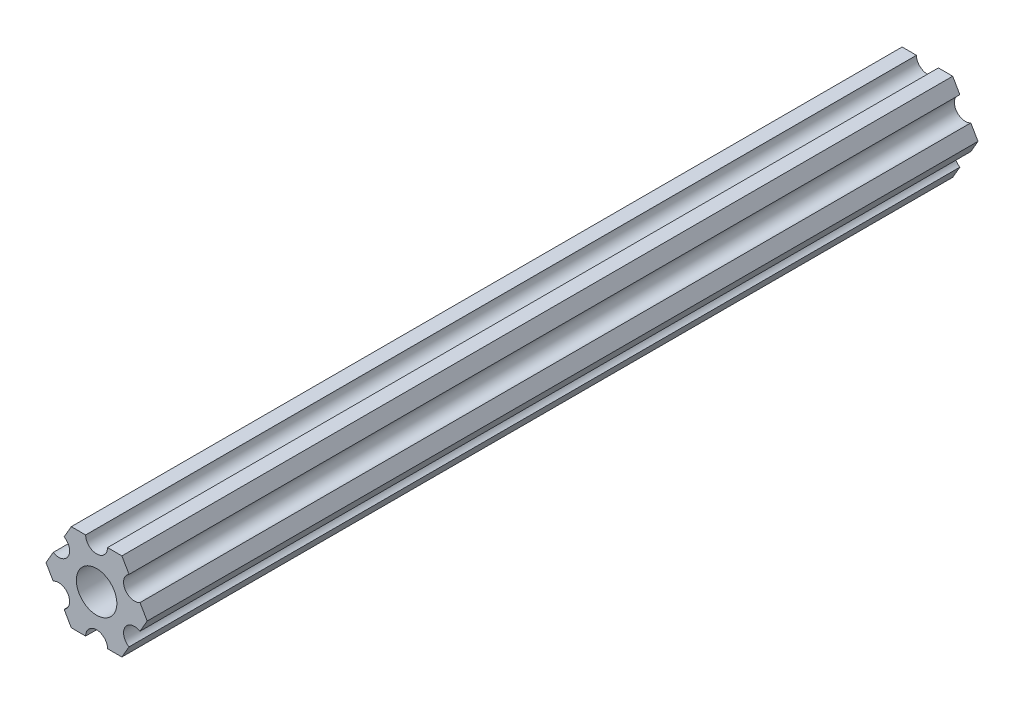
ISO-10303-21;
HEADER;
FILE_DESCRIPTION(('STEP AP214'),'2;1');
FILE_NAME('part.step','',(''),(''),'','','');
FILE_SCHEMA(('AUTOMOTIVE_DESIGN { 1 0 10303 214 1 1 1 1 }'));
ENDSEC;
DATA;
#1=APPLICATION_CONTEXT('core data for automotive mechanical design processes');
#2=APPLICATION_PROTOCOL_DEFINITION('international standard','automotive_design',2000,#1);
#3=PRODUCT_CONTEXT('',#1,'mechanical');
#4=PRODUCT('Part','Part','',(#3));
#5=PRODUCT_RELATED_PRODUCT_CATEGORY('part','',(#4));
#6=PRODUCT_DEFINITION_FORMATION('','',#4);
#7=PRODUCT_DEFINITION_CONTEXT('part definition',#1,'design');
#8=PRODUCT_DEFINITION('design','',#6,#7);
#9=PRODUCT_DEFINITION_SHAPE('','',#8);
#10=(LENGTH_UNIT() NAMED_UNIT(*) SI_UNIT(.MILLI.,.METRE.));
#11=(NAMED_UNIT(*) PLANE_ANGLE_UNIT() SI_UNIT($,.RADIAN.));
#12=(NAMED_UNIT(*) SI_UNIT($,.STERADIAN.) SOLID_ANGLE_UNIT());
#13=UNCERTAINTY_MEASURE_WITH_UNIT(LENGTH_MEASURE(1.E-05),#10,'distance_accuracy_value','');
#14=(GEOMETRIC_REPRESENTATION_CONTEXT(3) GLOBAL_UNCERTAINTY_ASSIGNED_CONTEXT((#13)) GLOBAL_UNIT_ASSIGNED_CONTEXT((#10,
#11,#12)) REPRESENTATION_CONTEXT('',''));
#15=CARTESIAN_POINT('',(0.,0.,0.));
#16=DIRECTION('',(0.,0.,1.));
#17=DIRECTION('',(1.,0.,0.));
#18=AXIS2_PLACEMENT_3D('',#15,#16,#17);
#19=CARTESIAN_POINT('',(6.29301142309098,-1.80018429024546,304.8));
#20=DIRECTION('',(-0.866025434075723,0.499999947533953,0.));
#21=DIRECTION('',(-0.499999947533953,-0.866025434075723,0.));
#22=AXIS2_PLACEMENT_3D('',#19,#20,#21);
#23=PLANE('',#22);
#24=DIRECTION('',(0.499999947533953,0.866025434075723,0.));
#25=VECTOR('',#24,1.);
#26=CARTESIAN_POINT('',(6.29301142309098,-1.80018429024546,-52.7));
#27=LINE('',#26,#25);
#28=CARTESIAN_POINT('',(6.29301142309098,-1.80018429024546,-52.7));
#29=VERTEX_POINT('',#28);
#30=CARTESIAN_POINT('',(7.33234841870826,4.44212518896171E-07,-52.7));
#31=VERTEX_POINT('',#30);
#32=EDGE_CURVE('E140',#29,#31,#27,.T.);
#33=ORIENTED_EDGE('',*,*,#32,.T.);
#34=DIRECTION('',(0.,0.,1.));
#35=VECTOR('',#34,1.);
#36=CARTESIAN_POINT('',(7.33234841870826,4.44212519225153E-07,304.8));
#37=LINE('',#36,#35);
#38=CARTESIAN_POINT('',(7.33234841870826,4.44212519207655E-07,67.726));
#39=VERTEX_POINT('',#38);
#40=EDGE_CURVE('E127',#31,#39,#37,.T.);
#41=ORIENTED_EDGE('',*,*,#40,.T.);
#42=DIRECTION('',(0.499999947533953,0.866025434075723,0.));
#43=VECTOR('',#42,1.);
#44=CARTESIAN_POINT('',(6.29301142309098,-1.80018429024546,67.726));
#45=LINE('',#44,#43);
#46=CARTESIAN_POINT('',(6.29301142309098,-1.80018429024546,67.726));
#47=VERTEX_POINT('',#46);
#48=EDGE_CURVE('E146',#47,#39,#45,.T.);
#49=ORIENTED_EDGE('',*,*,#48,.F.);
#50=DIRECTION('',(0.,0.,-1.));
#51=VECTOR('',#50,1.);
#52=CARTESIAN_POINT('',(6.29301142309098,-1.80018429024546,304.8));
#53=LINE('',#52,#51);
#54=EDGE_CURVE('E145',#47,#29,#53,.T.);
#55=ORIENTED_EDGE('',*,*,#54,.T.);
#56=EDGE_LOOP('',(#33,#41,#49,#55));
#57=FACE_BOUND('',#56,.T.);
#58=ADVANCED_FACE('F16',(#57),#23,.F.);
#59=CARTESIAN_POINT('',(7.33234841870826,4.44212519169686E-07,304.8));
#60=DIRECTION('',(-0.866025373493145,-0.500000052466056,0.));
#61=DIRECTION('',(0.500000052466056,-0.866025373493145,0.));
#62=AXIS2_PLACEMENT_3D('',#59,#60,#61);
#63=PLANE('',#62);
#64=DIRECTION('',(-0.500000052466056,0.866025373493145,0.));
#65=VECTOR('',#64,1.);
#66=CARTESIAN_POINT('',(7.33234841870826,4.44212519198905E-07,-52.7));
#67=LINE('',#66,#65);
#68=CARTESIAN_POINT('',(6.29301120497139,1.80018505273894,-52.7));
#69=VERTEX_POINT('',#68);
#70=EDGE_CURVE('E130',#31,#69,#67,.T.);
#71=ORIENTED_EDGE('',*,*,#70,.T.);
#72=DIRECTION('',(0.,0.,-1.));
#73=VECTOR('',#72,1.);
#74=CARTESIAN_POINT('',(6.29301120497139,1.80018505273894,304.8));
#75=LINE('',#74,#73);
#76=CARTESIAN_POINT('',(6.29301120497139,1.80018505273894,67.726));
#77=VERTEX_POINT('',#76);
#78=EDGE_CURVE('E119',#69,#77,#75,.F.);
#79=ORIENTED_EDGE('',*,*,#78,.T.);
#80=DIRECTION('',(-0.500000052466056,0.866025373493145,0.));
#81=VECTOR('',#80,1.);
#82=CARTESIAN_POINT('',(7.33234841870826,4.44212519198905E-07,67.726));
#83=LINE('',#82,#81);
#84=EDGE_CURVE('E131',#39,#77,#83,.T.);
#85=ORIENTED_EDGE('',*,*,#84,.F.);
#86=ORIENTED_EDGE('',*,*,#40,.F.);
#87=EDGE_LOOP('',(#71,#79,#85,#86));
#88=FACE_BOUND('',#87,.T.);
#89=ADVANCED_FACE('F129',(#88),#63,.F.);
#90=CARTESIAN_POINT('',(5.49926112168156,3.17500033315933,304.8));
#91=DIRECTION('',(0.,0.,-1.));
#92=DIRECTION('',(-1.,0.,0.));
#93=AXIS2_PLACEMENT_3D('',#90,#91,#92);
#94=CYLINDRICAL_SURFACE('',#93,1.5875);
#95=CARTESIAN_POINT('',(5.49926112168156,3.17500033315933,-52.7));
#96=DIRECTION('',(0.,0.,-1.));
#97=DIRECTION('',(-1.,0.,0.));
#98=AXIS2_PLACEMENT_3D('',#95,#96,#97);
#99=CIRCLE('',#98,1.5875);
#100=CARTESIAN_POINT('',(4.70551103839172,4.54981561357972,-52.7));
#101=VERTEX_POINT('',#100);
#102=EDGE_CURVE('E19',#69,#101,#99,.T.);
#103=ORIENTED_EDGE('',*,*,#102,.T.);
#104=DIRECTION('',(0.,0.,1.));
#105=VECTOR('',#104,1.);
#106=CARTESIAN_POINT('',(4.70551103839172,4.54981561357972,304.8));
#107=LINE('',#106,#105);
#108=CARTESIAN_POINT('',(4.70551103839172,4.54981561357972,67.726));
#109=VERTEX_POINT('',#108);
#110=EDGE_CURVE('E262',#101,#109,#107,.T.);
#111=ORIENTED_EDGE('',*,*,#110,.T.);
#112=CARTESIAN_POINT('',(5.49926112168156,3.17500033315933,67.726));
#113=DIRECTION('',(0.,0.,-1.));
#114=DIRECTION('',(-1.,0.,0.));
#115=AXIS2_PLACEMENT_3D('',#112,#113,#114);
#116=CIRCLE('',#115,1.5875);
#117=EDGE_CURVE('E290',#77,#109,#116,.T.);
#118=ORIENTED_EDGE('',*,*,#117,.F.);
#119=ORIENTED_EDGE('',*,*,#78,.F.);
#120=EDGE_LOOP('',(#103,#111,#118,#119));
#121=FACE_BOUND('',#120,.T.);
#122=ADVANCED_FACE('F560',(#121),#94,.F.);
#123=CARTESIAN_POINT('',(4.70551103839172,4.54981561357972,304.8));
#124=DIRECTION('',(-0.866025373493151,-0.500000052466046,0.));
#125=DIRECTION('',(0.500000052466046,-0.866025373493151,0.));
#126=AXIS2_PLACEMENT_3D('',#123,#124,#125);
#127=PLANE('',#126);
#128=DIRECTION('',(-0.500000052466044,0.866025373493152,0.));
#129=VECTOR('',#128,1.);
#130=CARTESIAN_POINT('',(4.70551103839172,4.54981561357972,-52.7));
#131=LINE('',#130,#129);
#132=CARTESIAN_POINT('',(3.66617382465481,6.35000022210627,-52.7000000000001));
#133=VERTEX_POINT('',#132);
#134=EDGE_CURVE('E204',#101,#133,#131,.T.);
#135=ORIENTED_EDGE('',*,*,#134,.T.);
#136=DIRECTION('',(0.,0.,1.));
#137=VECTOR('',#136,1.);
#138=CARTESIAN_POINT('',(3.66617382465481,6.35000022210627,304.8));
#139=LINE('',#138,#137);
#140=CARTESIAN_POINT('',(3.66617382465481,6.35000022210627,67.726));
#141=VERTEX_POINT('',#140);
#142=EDGE_CURVE('E259',#133,#141,#139,.T.);
#143=ORIENTED_EDGE('',*,*,#142,.T.);
#144=DIRECTION('',(-0.500000052466044,0.866025373493152,0.));
#145=VECTOR('',#144,1.);
#146=CARTESIAN_POINT('',(4.70551103839172,4.54981561357972,67.726));
#147=LINE('',#146,#145);
#148=EDGE_CURVE('E291',#109,#141,#147,.T.);
#149=ORIENTED_EDGE('',*,*,#148,.F.);
#150=ORIENTED_EDGE('',*,*,#110,.F.);
#151=EDGE_LOOP('',(#135,#143,#149,#150));
#152=FACE_BOUND('',#151,.T.);
#153=ADVANCED_FACE('F314',(#152),#127,.F.);
#154=CARTESIAN_POINT('',(3.66617382465481,6.35000022210627,304.8));
#155=DIRECTION('',(6.05825850611185E-08,-0.999999999999998,0.));
#156=DIRECTION('',(0.999999999999998,6.05825850611185E-08,0.));
#157=AXIS2_PLACEMENT_3D('',#154,#155,#156);
#158=PLANE('',#157);
#159=DIRECTION('',(1.,0.,0.));
#160=VECTOR('',#159,1.);
#161=CARTESIAN_POINT('',(5.49926112168156,6.35000022210627,-52.7));
#162=LINE('',#161,#160);
#163=CARTESIAN_POINT('',(1.58749961530073,6.35000015914054,-52.7));
#164=VERTEX_POINT('',#163);
#165=EDGE_CURVE('E201',#133,#164,#162,.F.);
#166=ORIENTED_EDGE('',*,*,#165,.T.);
#167=DIRECTION('',(0.,0.,-1.));
#168=VECTOR('',#167,1.);
#169=CARTESIAN_POINT('',(1.58749961530074,6.35000009617482,304.8));
#170=LINE('',#169,#168);
#171=CARTESIAN_POINT('',(1.58749961530073,6.35000015914054,67.726));
#172=VERTEX_POINT('',#171);
#173=EDGE_CURVE('E256',#164,#172,#170,.F.);
#174=ORIENTED_EDGE('',*,*,#173,.T.);
#175=DIRECTION('',(1.,0.,0.));
#176=VECTOR('',#175,1.);
#177=CARTESIAN_POINT('',(5.49926112168156,6.35000022210627,67.726));
#178=LINE('',#177,#176);
#179=EDGE_CURVE('E289',#141,#172,#178,.F.);
#180=ORIENTED_EDGE('',*,*,#179,.F.);
#181=ORIENTED_EDGE('',*,*,#142,.F.);
#182=EDGE_LOOP('',(#166,#174,#180,#181));
#183=FACE_BOUND('',#182,.T.);
#184=ADVANCED_FACE('F309',(#183),#158,.F.);
#185=CARTESIAN_POINT('',(-3.84699260060323E-07,6.35,304.8));
#186=DIRECTION('',(0.,0.,-1.));
#187=DIRECTION('',(-1.,0.,0.));
#188=AXIS2_PLACEMENT_3D('',#185,#186,#187);
#189=CYLINDRICAL_SURFACE('',#188,1.5875);
#190=CARTESIAN_POINT('',(-3.84699260060323E-07,6.35,-52.7));
#191=DIRECTION('',(0.,0.,-1.));
#192=DIRECTION('',(-1.,0.,0.));
#193=AXIS2_PLACEMENT_3D('',#190,#191,#192);
#194=CIRCLE('',#193,1.5875);
#195=CARTESIAN_POINT('',(-1.58750038469926,6.34999990382518,-52.7));
#196=VERTEX_POINT('',#195);
#197=EDGE_CURVE('E198',#164,#196,#194,.T.);
#198=ORIENTED_EDGE('',*,*,#197,.T.);
#199=DIRECTION('',(0.,0.,1.));
#200=VECTOR('',#199,1.);
#201=CARTESIAN_POINT('',(-1.58750038469926,6.34999990382518,304.8));
#202=LINE('',#201,#200);
#203=CARTESIAN_POINT('',(-1.58750038469926,6.34999990382518,67.726));
#204=VERTEX_POINT('',#203);
#205=EDGE_CURVE('E251',#196,#204,#202,.T.);
#206=ORIENTED_EDGE('',*,*,#205,.T.);
#207=CARTESIAN_POINT('',(-3.84699260060323E-07,6.35,67.726));
#208=DIRECTION('',(0.,0.,-1.));
#209=DIRECTION('',(-1.,0.,0.));
#210=AXIS2_PLACEMENT_3D('',#207,#208,#209);
#211=CIRCLE('',#210,1.5875);
#212=EDGE_CURVE('E286',#172,#204,#211,.T.);
#213=ORIENTED_EDGE('',*,*,#212,.F.);
#214=ORIENTED_EDGE('',*,*,#173,.F.);
#215=EDGE_LOOP('',(#198,#206,#213,#214));
#216=FACE_BOUND('',#215,.T.);
#217=ADVANCED_FACE('F301',(#216),#189,.F.);
#218=CARTESIAN_POINT('',(-1.58750038469926,6.34999990382518,304.8));
#219=DIRECTION('',(6.05825963273174E-08,-0.999999999999998,0.));
#220=DIRECTION('',(0.999999999999998,6.05825963273174E-08,0.));
#221=AXIS2_PLACEMENT_3D('',#218,#219,#220);
#222=PLANE('',#221);
#223=DIRECTION('',(1.,0.,0.));
#224=VECTOR('',#223,1.);
#225=CARTESIAN_POINT('',(5.49926112168156,6.34999990382519,-52.7));
#226=LINE('',#225,#224);
#227=CARTESIAN_POINT('',(-3.66617454558244,6.34999986184803,-52.7000000000001));
#228=VERTEX_POINT('',#227);
#229=EDGE_CURVE('E193',#196,#228,#226,.F.);
#230=ORIENTED_EDGE('',*,*,#229,.T.);
#231=DIRECTION('',(0.,0.,1.));
#232=VECTOR('',#231,1.);
#233=CARTESIAN_POINT('',(-3.66617459405349,6.3499997778937,304.8));
#234=LINE('',#233,#232);
#235=CARTESIAN_POINT('',(-3.66617454558244,6.34999986184803,67.726));
#236=VERTEX_POINT('',#235);
#237=EDGE_CURVE('E248',#228,#236,#234,.T.);
#238=ORIENTED_EDGE('',*,*,#237,.T.);
#239=DIRECTION('',(1.,0.,0.));
#240=VECTOR('',#239,1.);
#241=CARTESIAN_POINT('',(5.49926112168156,6.34999990382519,67.726));
#242=LINE('',#241,#240);
#243=EDGE_CURVE('E288',#204,#236,#242,.F.);
#244=ORIENTED_EDGE('',*,*,#243,.F.);
#245=ORIENTED_EDGE('',*,*,#205,.F.);
#246=EDGE_LOOP('',(#230,#238,#244,#245));
#247=FACE_BOUND('',#246,.T.);
#248=ADVANCED_FACE('F369',(#247),#222,.F.);
#249=CARTESIAN_POINT('',(-3.66617459405349,6.3499997778937,304.8));
#250=DIRECTION('',(0.866025434075729,-0.499999947533943,0.));
#251=DIRECTION('',(0.499999947533943,0.866025434075729,0.));
#252=AXIS2_PLACEMENT_3D('',#249,#250,#251);
#253=PLANE('',#252);
#254=DIRECTION('',(-0.499999947533941,-0.86602543407573,0.));
#255=VECTOR('',#254,1.);
#256=CARTESIAN_POINT('',(-3.66617459405349,6.3499997778937,-52.7));
#257=LINE('',#256,#255);
#258=CARTESIAN_POINT('',(-4.70551158967065,4.54981504343587,-52.7));
#259=VERTEX_POINT('',#258);
#260=EDGE_CURVE('E190',#228,#259,#257,.T.);
#261=ORIENTED_EDGE('',*,*,#260,.T.);
#262=DIRECTION('',(0.,0.,-1.));
#263=VECTOR('',#262,1.);
#264=CARTESIAN_POINT('',(-4.70551158967065,4.54981504343587,304.8));
#265=LINE('',#264,#263);
#266=CARTESIAN_POINT('',(-4.70551158967065,4.54981504343587,67.726));
#267=VERTEX_POINT('',#266);
#268=EDGE_CURVE('E245',#259,#267,#265,.F.);
#269=ORIENTED_EDGE('',*,*,#268,.T.);
#270=DIRECTION('',(-0.499999947533941,-0.86602543407573,0.));
#271=VECTOR('',#270,1.);
#272=CARTESIAN_POINT('',(-3.66617459405349,6.3499997778937,67.726));
#273=LINE('',#272,#271);
#274=EDGE_CURVE('E285',#236,#267,#273,.T.);
#275=ORIENTED_EDGE('',*,*,#274,.F.);
#276=ORIENTED_EDGE('',*,*,#237,.F.);
#277=EDGE_LOOP('',(#261,#269,#275,#276));
#278=FACE_BOUND('',#277,.T.);
#279=ADVANCED_FACE('F371',(#278),#253,.F.);
#280=CARTESIAN_POINT('',(-5.49926150638082,3.17499966684067,304.8));
#281=DIRECTION('',(0.,0.,-1.));
#282=DIRECTION('',(-1.,0.,0.));
#283=AXIS2_PLACEMENT_3D('',#280,#281,#282);
#284=CYLINDRICAL_SURFACE('',#283,1.5875);
#285=CARTESIAN_POINT('',(-5.49926150638082,3.17499966684067,-52.7));
#286=DIRECTION('',(0.,0.,-1.));
#287=DIRECTION('',(-1.,0.,0.));
#288=AXIS2_PLACEMENT_3D('',#285,#286,#287);
#289=CIRCLE('',#288,1.5875);
#290=CARTESIAN_POINT('',(-6.29301142309098,1.80018429024547,-52.7));
#291=VERTEX_POINT('',#290);
#292=EDGE_CURVE('E187',#259,#291,#289,.T.);
#293=ORIENTED_EDGE('',*,*,#292,.T.);
#294=DIRECTION('',(0.,0.,1.));
#295=VECTOR('',#294,1.);
#296=CARTESIAN_POINT('',(-6.29301142309098,1.80018429024547,304.8));
#297=LINE('',#296,#295);
#298=CARTESIAN_POINT('',(-6.29301142309098,1.80018429024547,67.726));
#299=VERTEX_POINT('',#298);
#300=EDGE_CURVE('E240',#291,#299,#297,.T.);
#301=ORIENTED_EDGE('',*,*,#300,.T.);
#302=CARTESIAN_POINT('',(-5.49926150638082,3.17499966684067,67.726));
#303=DIRECTION('',(0.,0.,-1.));
#304=DIRECTION('',(-1.,0.,0.));
#305=AXIS2_PLACEMENT_3D('',#302,#303,#304);
#306=CIRCLE('',#305,1.5875);
#307=EDGE_CURVE('E282',#267,#299,#306,.T.);
#308=ORIENTED_EDGE('',*,*,#307,.F.);
#309=ORIENTED_EDGE('',*,*,#268,.F.);
#310=EDGE_LOOP('',(#293,#301,#308,#309));
#311=FACE_BOUND('',#310,.T.);
#312=ADVANCED_FACE('F407',(#311),#284,.F.);
#313=CARTESIAN_POINT('',(-6.29301142309098,1.80018429024547,304.8));
#314=DIRECTION('',(0.866025434075724,-0.499999947533951,0.));
#315=DIRECTION('',(0.499999947533951,0.866025434075724,0.));
#316=AXIS2_PLACEMENT_3D('',#313,#314,#315);
#317=PLANE('',#316);
#318=DIRECTION('',(-0.49999994753395,-0.866025434075724,0.));
#319=VECTOR('',#318,1.);
#320=CARTESIAN_POINT('',(-6.29301142309098,1.80018429024547,-52.7));
#321=LINE('',#320,#319);
#322=CARTESIAN_POINT('',(-7.33234841870826,-4.44212523605446E-07,-52.7000000000001));
#323=VERTEX_POINT('',#322);
#324=EDGE_CURVE('E182',#291,#323,#321,.T.);
#325=ORIENTED_EDGE('',*,*,#324,.T.);
#326=DIRECTION('',(0.,0.,1.));
#327=VECTOR('',#326,1.);
#328=CARTESIAN_POINT('',(-7.33234841870826,-4.44212523744911E-07,304.8));
#329=LINE('',#328,#327);
#330=CARTESIAN_POINT('',(-7.33234841870826,-4.44212523605446E-07,67.726));
#331=VERTEX_POINT('',#330);
#332=EDGE_CURVE('E237',#323,#331,#329,.T.);
#333=ORIENTED_EDGE('',*,*,#332,.T.);
#334=DIRECTION('',(-0.49999994753395,-0.866025434075724,0.));
#335=VECTOR('',#334,1.);
#336=CARTESIAN_POINT('',(-6.29301142309098,1.80018429024547,67.726));
#337=LINE('',#336,#335);
#338=EDGE_CURVE('E284',#299,#331,#337,.T.);
#339=ORIENTED_EDGE('',*,*,#338,.F.);
#340=ORIENTED_EDGE('',*,*,#300,.F.);
#341=EDGE_LOOP('',(#325,#333,#339,#340));
#342=FACE_BOUND('',#341,.T.);
#343=ADVANCED_FACE('F360',(#342),#317,.F.);
#344=CARTESIAN_POINT('',(-7.33234841870826,-4.44212523790841E-07,304.8));
#345=DIRECTION('',(0.866025373493151,0.500000052466045,0.));
#346=DIRECTION('',(-0.500000052466045,0.866025373493151,0.));
#347=AXIS2_PLACEMENT_3D('',#344,#345,#346);
#348=PLANE('',#347);
#349=DIRECTION('',(0.500000052466043,-0.866025373493152,0.));
#350=VECTOR('',#349,1.);
#351=CARTESIAN_POINT('',(-7.33234841870826,-4.44212523535714E-07,-52.7));
#352=LINE('',#351,#350);
#353=CARTESIAN_POINT('',(-6.29301120497141,-1.80018505273897,-52.7));
#354=VERTEX_POINT('',#353);
#355=EDGE_CURVE('E179',#323,#354,#352,.T.);
#356=ORIENTED_EDGE('',*,*,#355,.T.);
#357=DIRECTION('',(0.,0.,-1.));
#358=VECTOR('',#357,1.);
#359=CARTESIAN_POINT('',(-6.29301120497141,-1.80018505273897,304.8));
#360=LINE('',#359,#358);
#361=CARTESIAN_POINT('',(-6.29301120497141,-1.80018505273897,67.726));
#362=VERTEX_POINT('',#361);
#363=EDGE_CURVE('E234',#354,#362,#360,.F.);
#364=ORIENTED_EDGE('',*,*,#363,.T.);
#365=DIRECTION('',(0.500000052466043,-0.866025373493152,0.));
#366=VECTOR('',#365,1.);
#367=CARTESIAN_POINT('',(-7.33234841870826,-4.44212523535714E-07,67.726));
#368=LINE('',#367,#366);
#369=EDGE_CURVE('E281',#331,#362,#368,.T.);
#370=ORIENTED_EDGE('',*,*,#369,.F.);
#371=ORIENTED_EDGE('',*,*,#332,.F.);
#372=EDGE_LOOP('',(#356,#364,#370,#371));
#373=FACE_BOUND('',#372,.T.);
#374=ADVANCED_FACE('F355',(#373),#348,.F.);
#375=CARTESIAN_POINT('',(-5.49926112168156,-3.17500033315934,304.8));
#376=DIRECTION('',(0.,0.,-1.));
#377=DIRECTION('',(-1.,0.,0.));
#378=AXIS2_PLACEMENT_3D('',#375,#376,#377);
#379=CYLINDRICAL_SURFACE('',#378,1.5875);
#380=CARTESIAN_POINT('',(-5.49926112168156,-3.17500033315934,-52.7));
#381=DIRECTION('',(0.,0.,-1.));
#382=DIRECTION('',(-1.,0.,0.));
#383=AXIS2_PLACEMENT_3D('',#380,#381,#382);
#384=CIRCLE('',#383,1.5875);
#385=CARTESIAN_POINT('',(-4.70551103839172,-4.54981561357972,-52.7));
#386=VERTEX_POINT('',#385);
#387=EDGE_CURVE('E176',#354,#386,#384,.T.);
#388=ORIENTED_EDGE('',*,*,#387,.T.);
#389=DIRECTION('',(0.,0.,1.));
#390=VECTOR('',#389,1.);
#391=CARTESIAN_POINT('',(-4.70551103839172,-4.54981561357972,304.8));
#392=LINE('',#391,#390);
#393=CARTESIAN_POINT('',(-4.70551103839172,-4.54981561357972,67.726));
#394=VERTEX_POINT('',#393);
#395=EDGE_CURVE('E229',#386,#394,#392,.T.);
#396=ORIENTED_EDGE('',*,*,#395,.T.);
#397=CARTESIAN_POINT('',(-5.49926112168156,-3.17500033315934,67.726));
#398=DIRECTION('',(0.,0.,-1.));
#399=DIRECTION('',(-1.,0.,0.));
#400=AXIS2_PLACEMENT_3D('',#397,#398,#399);
#401=CIRCLE('',#400,1.5875);
#402=EDGE_CURVE('E278',#362,#394,#401,.T.);
#403=ORIENTED_EDGE('',*,*,#402,.F.);
#404=ORIENTED_EDGE('',*,*,#363,.F.);
#405=EDGE_LOOP('',(#388,#396,#403,#404));
#406=FACE_BOUND('',#405,.T.);
#407=ADVANCED_FACE('F350',(#406),#379,.F.);
#408=CARTESIAN_POINT('',(-4.70551103839172,-4.54981561357972,304.8));
#409=DIRECTION('',(0.866025373493151,0.500000052466045,0.));
#410=DIRECTION('',(-0.500000052466045,0.866025373493151,0.));
#411=AXIS2_PLACEMENT_3D('',#408,#409,#410);
#412=PLANE('',#411);
#413=DIRECTION('',(0.500000052466043,-0.866025373493152,0.));
#414=VECTOR('',#413,1.);
#415=CARTESIAN_POINT('',(-4.70551103839172,-4.54981561357972,-52.7));
#416=LINE('',#415,#414);
#417=CARTESIAN_POINT('',(-3.66617382465481,-6.35000022210627,-52.7000000000001));
#418=VERTEX_POINT('',#417);
#419=EDGE_CURVE('E171',#386,#418,#416,.T.);
#420=ORIENTED_EDGE('',*,*,#419,.T.);
#421=DIRECTION('',(0.,0.,1.));
#422=VECTOR('',#421,1.);
#423=CARTESIAN_POINT('',(-3.66617382465481,-6.35000022210627,304.8));
#424=LINE('',#423,#422);
#425=CARTESIAN_POINT('',(-3.66617382465481,-6.35000022210627,67.726));
#426=VERTEX_POINT('',#425);
#427=EDGE_CURVE('E226',#418,#426,#424,.T.);
#428=ORIENTED_EDGE('',*,*,#427,.T.);
#429=DIRECTION('',(0.500000052466043,-0.866025373493152,0.));
#430=VECTOR('',#429,1.);
#431=CARTESIAN_POINT('',(-4.70551103839172,-4.54981561357972,67.726));
#432=LINE('',#431,#430);
#433=EDGE_CURVE('E280',#394,#426,#432,.T.);
#434=ORIENTED_EDGE('',*,*,#433,.F.);
#435=ORIENTED_EDGE('',*,*,#395,.F.);
#436=EDGE_LOOP('',(#420,#428,#434,#435));
#437=FACE_BOUND('',#436,.T.);
#438=ADVANCED_FACE('F345',(#437),#412,.F.);
#439=CARTESIAN_POINT('',(-3.66617382465481,-6.35000022210627,304.8));
#440=DIRECTION('',(-6.05825854783851E-08,0.999999999999998,0.));
#441=DIRECTION('',(-0.999999999999998,-6.05825854783851E-08,0.));
#442=AXIS2_PLACEMENT_3D('',#439,#440,#441);
#443=PLANE('',#442);
#444=DIRECTION('',(1.,0.,0.));
#445=VECTOR('',#444,1.);
#446=CARTESIAN_POINT('',(5.49926112168156,-6.35000022210627,-52.7));
#447=LINE('',#446,#445);
#448=CARTESIAN_POINT('',(-1.58749961530073,-6.35000011105313,-52.7));
#449=VERTEX_POINT('',#448);
#450=EDGE_CURVE('E168',#418,#449,#447,.T.);
#451=ORIENTED_EDGE('',*,*,#450,.T.);
#452=DIRECTION('',(0.,0.,-1.));
#453=VECTOR('',#452,1.);
#454=CARTESIAN_POINT('',(-1.58749961530074,-6.35,304.8));
#455=LINE('',#454,#453);
#456=CARTESIAN_POINT('',(-1.58749961530073,-6.35000011105313,67.726));
#457=VERTEX_POINT('',#456);
#458=EDGE_CURVE('E223',#449,#457,#455,.F.);
#459=ORIENTED_EDGE('',*,*,#458,.T.);
#460=DIRECTION('',(1.,0.,0.));
#461=VECTOR('',#460,1.);
#462=CARTESIAN_POINT('',(5.49926112168156,-6.35000022210627,67.726));
#463=LINE('',#462,#461);
#464=EDGE_CURVE('E277',#426,#457,#463,.T.);
#465=ORIENTED_EDGE('',*,*,#464,.F.);
#466=ORIENTED_EDGE('',*,*,#427,.F.);
#467=EDGE_LOOP('',(#451,#459,#465,#466));
#468=FACE_BOUND('',#467,.T.);
#469=ADVANCED_FACE('F339',(#468),#443,.F.);
#470=CARTESIAN_POINT('',(3.8469926204343E-07,-6.35,304.8));
#471=DIRECTION('',(0.,0.,-1.));
#472=DIRECTION('',(-1.,0.,0.));
#473=AXIS2_PLACEMENT_3D('',#470,#471,#472);
#474=CYLINDRICAL_SURFACE('',#473,1.5875);
#475=CARTESIAN_POINT('',(3.8469926204343E-07,-6.35,-52.7));
#476=DIRECTION('',(0.,0.,-1.));
#477=DIRECTION('',(-1.,0.,0.));
#478=AXIS2_PLACEMENT_3D('',#475,#476,#477);
#479=CIRCLE('',#478,1.5875);
#480=CARTESIAN_POINT('',(1.58750038469926,-6.34999990382518,-52.7));
#481=VERTEX_POINT('',#480);
#482=EDGE_CURVE('E165',#449,#481,#479,.T.);
#483=ORIENTED_EDGE('',*,*,#482,.T.);
#484=DIRECTION('',(0.,0.,1.));
#485=VECTOR('',#484,1.);
#486=CARTESIAN_POINT('',(1.58750038469926,-6.34999990382518,304.8));
#487=LINE('',#486,#485);
#488=CARTESIAN_POINT('',(1.58750038469926,-6.34999990382518,67.726));
#489=VERTEX_POINT('',#488);
#490=EDGE_CURVE('E218',#481,#489,#487,.T.);
#491=ORIENTED_EDGE('',*,*,#490,.T.);
#492=CARTESIAN_POINT('',(3.8469926204343E-07,-6.35,67.726));
#493=DIRECTION('',(0.,0.,-1.));
#494=DIRECTION('',(-1.,0.,0.));
#495=AXIS2_PLACEMENT_3D('',#492,#493,#494);
#496=CIRCLE('',#495,1.5875);
#497=EDGE_CURVE('E274',#457,#489,#496,.T.);
#498=ORIENTED_EDGE('',*,*,#497,.F.);
#499=ORIENTED_EDGE('',*,*,#458,.F.);
#500=EDGE_LOOP('',(#483,#491,#498,#499));
#501=FACE_BOUND('',#500,.T.);
#502=ADVANCED_FACE('F335',(#501),#474,.F.);
#503=CARTESIAN_POINT('',(1.58750038469926,-6.34999990382518,304.8));
#504=DIRECTION('',(-6.05825721258438E-08,0.999999999999998,0.));
#505=DIRECTION('',(-0.999999999999998,-6.05825721258438E-08,0.));
#506=AXIS2_PLACEMENT_3D('',#503,#504,#505);
#507=PLANE('',#506);
#508=DIRECTION('',(1.,0.,0.));
#509=VECTOR('',#508,1.);
#510=CARTESIAN_POINT('',(5.49926112168156,-6.34999990382518,-52.7));
#511=LINE('',#510,#509);
#512=CARTESIAN_POINT('',(3.66617454558244,-6.34999986184804,-52.7));
#513=VERTEX_POINT('',#512);
#514=EDGE_CURVE('E160',#481,#513,#511,.T.);
#515=ORIENTED_EDGE('',*,*,#514,.T.);
#516=DIRECTION('',(0.,0.,1.));
#517=VECTOR('',#516,1.);
#518=CARTESIAN_POINT('',(3.66617459405346,-6.34999977789375,304.8));
#519=LINE('',#518,#517);
#520=CARTESIAN_POINT('',(3.66617454558244,-6.34999986184804,67.726));
#521=VERTEX_POINT('',#520);
#522=EDGE_CURVE('E215',#513,#521,#519,.T.);
#523=ORIENTED_EDGE('',*,*,#522,.T.);
#524=DIRECTION('',(1.,0.,0.));
#525=VECTOR('',#524,1.);
#526=CARTESIAN_POINT('',(5.49926112168156,-6.34999990382518,67.726));
#527=LINE('',#526,#525);
#528=EDGE_CURVE('E276',#489,#521,#527,.T.);
#529=ORIENTED_EDGE('',*,*,#528,.F.);
#530=ORIENTED_EDGE('',*,*,#490,.F.);
#531=EDGE_LOOP('',(#515,#523,#529,#530));
#532=FACE_BOUND('',#531,.T.);
#533=ADVANCED_FACE('F331',(#532),#507,.F.);
#534=CARTESIAN_POINT('',(3.66617459405346,-6.34999977789375,304.8));
#535=DIRECTION('',(-0.86602543407573,0.499999947533941,0.));
#536=DIRECTION('',(-0.499999947533941,-0.86602543407573,0.));
#537=AXIS2_PLACEMENT_3D('',#534,#535,#536);
#538=PLANE('',#537);
#539=DIRECTION('',(0.499999947533941,0.86602543407573,0.));
#540=VECTOR('',#539,1.);
#541=CARTESIAN_POINT('',(3.66617459405346,-6.34999977789375,-52.7));
#542=LINE('',#541,#540);
#543=CARTESIAN_POINT('',(4.70551158967065,-4.54981504343588,-52.7));
#544=VERTEX_POINT('',#543);
#545=EDGE_CURVE('E151',#513,#544,#542,.T.);
#546=ORIENTED_EDGE('',*,*,#545,.T.);
#547=DIRECTION('',(0.,0.,-1.));
#548=VECTOR('',#547,1.);
#549=CARTESIAN_POINT('',(4.70551158967065,-4.54981504343588,304.8));
#550=LINE('',#549,#548);
#551=CARTESIAN_POINT('',(4.70551158967065,-4.54981504343588,67.726));
#552=VERTEX_POINT('',#551);
#553=EDGE_CURVE('E143',#544,#552,#550,.F.);
#554=ORIENTED_EDGE('',*,*,#553,.T.);
#555=DIRECTION('',(0.499999947533941,0.86602543407573,0.));
#556=VECTOR('',#555,1.);
#557=CARTESIAN_POINT('',(3.66617459405346,-6.34999977789375,67.726));
#558=LINE('',#557,#556);
#559=EDGE_CURVE('E34',#521,#552,#558,.T.);
#560=ORIENTED_EDGE('',*,*,#559,.F.);
#561=ORIENTED_EDGE('',*,*,#522,.F.);
#562=EDGE_LOOP('',(#546,#554,#560,#561));
#563=FACE_BOUND('',#562,.T.);
#564=ADVANCED_FACE('F327',(#563),#538,.F.);
#565=CARTESIAN_POINT('',(5.49926150638082,-3.17499966684067,304.8));
#566=DIRECTION('',(0.,0.,-1.));
#567=DIRECTION('',(-1.,0.,0.));
#568=AXIS2_PLACEMENT_3D('',#565,#566,#567);
#569=CYLINDRICAL_SURFACE('',#568,1.58750000000001);
#570=CARTESIAN_POINT('',(5.49926150638082,-3.17499966684067,-52.7));
#571=DIRECTION('',(0.,0.,-1.));
#572=DIRECTION('',(-1.,0.,0.));
#573=AXIS2_PLACEMENT_3D('',#570,#571,#572);
#574=CIRCLE('',#573,1.58750000000001);
#575=EDGE_CURVE('E147',#544,#29,#574,.T.);
#576=ORIENTED_EDGE('',*,*,#575,.T.);
#577=ORIENTED_EDGE('',*,*,#54,.F.);
#578=CARTESIAN_POINT('',(5.49926150638082,-3.17499966684067,67.726));
#579=DIRECTION('',(0.,0.,-1.));
#580=DIRECTION('',(-1.,0.,0.));
#581=AXIS2_PLACEMENT_3D('',#578,#579,#580);
#582=CIRCLE('',#581,1.58750000000001);
#583=EDGE_CURVE('E272',#552,#47,#582,.T.);
#584=ORIENTED_EDGE('',*,*,#583,.F.);
#585=ORIENTED_EDGE('',*,*,#553,.F.);
#586=EDGE_LOOP('',(#576,#577,#584,#585));
#587=FACE_BOUND('',#586,.T.);
#588=ADVANCED_FACE('F322',(#587),#569,.F.);
#589=CARTESIAN_POINT('',(5.49926112168156,3.17500033315933,-52.7));
#590=DIRECTION('',(0.,0.,1.));
#591=DIRECTION('',(1.,0.,0.));
#592=AXIS2_PLACEMENT_3D('',#589,#590,#591);
#593=PLANE('',#592);
#594=CARTESIAN_POINT('',(0.,0.,-52.7));
#595=DIRECTION('',(0.,0.,-1.));
#596=DIRECTION('',(-1.,0.,0.));
#597=AXIS2_PLACEMENT_3D('',#594,#595,#596);
#598=CIRCLE('',#597,2.9337);
#599=CARTESIAN_POINT('',(-2.9337,0.,-52.7));
#600=VERTEX_POINT('',#599);
#601=EDGE_CURVE('E25',#600,#600,#598,.F.);
#602=ORIENTED_EDGE('',*,*,#601,.T.);
#603=EDGE_LOOP('',(#602));
#604=FACE_BOUND('',#603,.T.);
#605=ORIENTED_EDGE('',*,*,#575,.F.);
#606=ORIENTED_EDGE('',*,*,#545,.F.);
#607=ORIENTED_EDGE('',*,*,#514,.F.);
#608=ORIENTED_EDGE('',*,*,#482,.F.);
#609=ORIENTED_EDGE('',*,*,#450,.F.);
#610=ORIENTED_EDGE('',*,*,#419,.F.);
#611=ORIENTED_EDGE('',*,*,#387,.F.);
#612=ORIENTED_EDGE('',*,*,#355,.F.);
#613=ORIENTED_EDGE('',*,*,#324,.F.);
#614=ORIENTED_EDGE('',*,*,#292,.F.);
#615=ORIENTED_EDGE('',*,*,#260,.F.);
#616=ORIENTED_EDGE('',*,*,#229,.F.);
#617=ORIENTED_EDGE('',*,*,#197,.F.);
#618=ORIENTED_EDGE('',*,*,#165,.F.);
#619=ORIENTED_EDGE('',*,*,#134,.F.);
#620=ORIENTED_EDGE('',*,*,#102,.F.);
#621=ORIENTED_EDGE('',*,*,#70,.F.);
#622=ORIENTED_EDGE('',*,*,#32,.F.);
#623=EDGE_LOOP('',(#605,#606,#607,#608,#609,#610,#611,#612,#613,#614,#615,#616,#617,#618,#619,
#620,#621,#622));
#624=FACE_BOUND('',#623,.T.);
#625=ADVANCED_FACE('F139',(#604,#624),#593,.F.);
#626=CARTESIAN_POINT('',(5.49926112168156,3.17500033315933,67.726));
#627=DIRECTION('',(0.,0.,1.));
#628=DIRECTION('',(1.,0.,0.));
#629=AXIS2_PLACEMENT_3D('',#626,#627,#628);
#630=PLANE('',#629);
#631=CARTESIAN_POINT('',(0.,0.,67.726));
#632=DIRECTION('',(0.,0.,-1.));
#633=DIRECTION('',(-1.,0.,0.));
#634=AXIS2_PLACEMENT_3D('',#631,#632,#633);
#635=CIRCLE('',#634,2.9337);
#636=CARTESIAN_POINT('',(-2.9337,0.,67.726));
#637=VERTEX_POINT('',#636);
#638=EDGE_CURVE('E11',#637,#637,#635,.T.);
#639=ORIENTED_EDGE('',*,*,#638,.T.);
#640=EDGE_LOOP('',(#639));
#641=FACE_BOUND('',#640,.T.);
#642=ORIENTED_EDGE('',*,*,#559,.T.);
#643=ORIENTED_EDGE('',*,*,#583,.T.);
#644=ORIENTED_EDGE('',*,*,#48,.T.);
#645=ORIENTED_EDGE('',*,*,#84,.T.);
#646=ORIENTED_EDGE('',*,*,#117,.T.);
#647=ORIENTED_EDGE('',*,*,#148,.T.);
#648=ORIENTED_EDGE('',*,*,#179,.T.);
#649=ORIENTED_EDGE('',*,*,#212,.T.);
#650=ORIENTED_EDGE('',*,*,#243,.T.);
#651=ORIENTED_EDGE('',*,*,#274,.T.);
#652=ORIENTED_EDGE('',*,*,#307,.T.);
#653=ORIENTED_EDGE('',*,*,#338,.T.);
#654=ORIENTED_EDGE('',*,*,#369,.T.);
#655=ORIENTED_EDGE('',*,*,#402,.T.);
#656=ORIENTED_EDGE('',*,*,#433,.T.);
#657=ORIENTED_EDGE('',*,*,#464,.T.);
#658=ORIENTED_EDGE('',*,*,#497,.T.);
#659=ORIENTED_EDGE('',*,*,#528,.T.);
#660=EDGE_LOOP('',(#642,#643,#644,#645,#646,#647,#648,#649,#650,#651,#652,#653,#654,#655,#656,
#657,#658,#659));
#661=FACE_BOUND('',#660,.T.);
#662=ADVANCED_FACE('F319',(#641,#661),#630,.T.);
#663=CARTESIAN_POINT('',(0.,0.,304.8));
#664=DIRECTION('',(0.,0.,-1.));
#665=DIRECTION('',(-1.,0.,0.));
#666=AXIS2_PLACEMENT_3D('',#663,#664,#665);
#667=CYLINDRICAL_SURFACE('',#666,2.9337);
#668=ORIENTED_EDGE('',*,*,#601,.F.);
#669=EDGE_LOOP('',(#668));
#670=FACE_BOUND('',#669,.T.);
#671=ORIENTED_EDGE('',*,*,#638,.F.);
#672=EDGE_LOOP('',(#671));
#673=FACE_BOUND('',#672,.T.);
#674=ADVANCED_FACE('F417',(#670,#673),#667,.F.);
#675=CLOSED_SHELL('',(#58,#89,#122,#153,#184,#217,#248,#279,#312,#343,#374,#407,#438,#469,#502,
#533,#564,#588,#625,#662,#674));
#676=MANIFOLD_SOLID_BREP('B1',#675);
#677=ADVANCED_BREP_SHAPE_REPRESENTATION('',(#18,#676),#14);
#678=SHAPE_DEFINITION_REPRESENTATION(#9,#677);
ENDSEC;
END-ISO-10303-21;
